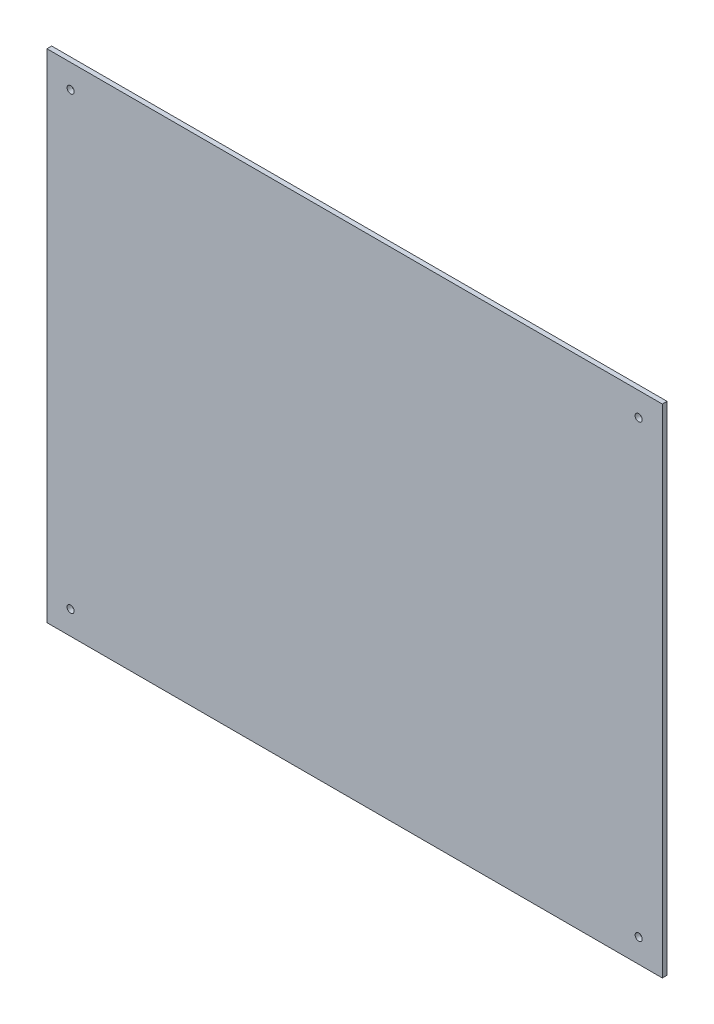
ISO-10303-21;
HEADER;
FILE_DESCRIPTION(('STEP AP214'),'2;1');
FILE_NAME('part.step','',(''),(''),'','','');
FILE_SCHEMA(('AUTOMOTIVE_DESIGN { 1 0 10303 214 1 1 1 1 }'));
ENDSEC;
DATA;
#1=APPLICATION_CONTEXT('core data for automotive mechanical design processes');
#2=APPLICATION_PROTOCOL_DEFINITION('international standard','automotive_design',2000,#1);
#3=PRODUCT_CONTEXT('',#1,'mechanical');
#4=PRODUCT('Part','Part','',(#3));
#5=PRODUCT_RELATED_PRODUCT_CATEGORY('part','',(#4));
#6=PRODUCT_DEFINITION_FORMATION('','',#4);
#7=PRODUCT_DEFINITION_CONTEXT('part definition',#1,'design');
#8=PRODUCT_DEFINITION('design','',#6,#7);
#9=PRODUCT_DEFINITION_SHAPE('','',#8);
#10=(LENGTH_UNIT() NAMED_UNIT(*) SI_UNIT(.MILLI.,.METRE.));
#11=(NAMED_UNIT(*) PLANE_ANGLE_UNIT() SI_UNIT($,.RADIAN.));
#12=(NAMED_UNIT(*) SI_UNIT($,.STERADIAN.) SOLID_ANGLE_UNIT());
#13=UNCERTAINTY_MEASURE_WITH_UNIT(LENGTH_MEASURE(1.E-05),#10,'distance_accuracy_value','');
#14=(GEOMETRIC_REPRESENTATION_CONTEXT(3) GLOBAL_UNCERTAINTY_ASSIGNED_CONTEXT((#13)) GLOBAL_UNIT_ASSIGNED_CONTEXT((#10,
#11,#12)) REPRESENTATION_CONTEXT('',''));
#15=CARTESIAN_POINT('',(0.,0.,0.));
#16=DIRECTION('',(0.,0.,1.));
#17=DIRECTION('',(1.,0.,0.));
#18=AXIS2_PLACEMENT_3D('',#15,#16,#17);
#19=CARTESIAN_POINT('',(0.,210.,2.));
#20=DIRECTION('',(1.,0.,0.));
#21=DIRECTION('',(0.,1.,0.));
#22=AXIS2_PLACEMENT_3D('',#19,#20,#21);
#23=PLANE('',#22);
#24=DIRECTION('',(0.,-1.,0.));
#25=VECTOR('',#24,1.);
#26=CARTESIAN_POINT('',(0.,210.,0.));
#27=LINE('',#26,#25);
#28=CARTESIAN_POINT('',(0.,210.,0.));
#29=VERTEX_POINT('',#28);
#30=CARTESIAN_POINT('',(0.,0.,0.));
#31=VERTEX_POINT('',#30);
#32=EDGE_CURVE('E98',#29,#31,#27,.T.);
#33=ORIENTED_EDGE('',*,*,#32,.T.);
#34=DIRECTION('',(0.,0.,-1.));
#35=VECTOR('',#34,1.);
#36=CARTESIAN_POINT('',(0.,0.,2.));
#37=LINE('',#36,#35);
#38=CARTESIAN_POINT('',(0.,0.,2.));
#39=VERTEX_POINT('',#38);
#40=EDGE_CURVE('E11',#39,#31,#37,.T.);
#41=ORIENTED_EDGE('',*,*,#40,.F.);
#42=DIRECTION('',(0.,-1.,0.));
#43=VECTOR('',#42,1.);
#44=CARTESIAN_POINT('',(0.,210.,2.));
#45=LINE('',#44,#43);
#46=CARTESIAN_POINT('',(0.,210.,2.));
#47=VERTEX_POINT('',#46);
#48=EDGE_CURVE('E86',#47,#39,#45,.T.);
#49=ORIENTED_EDGE('',*,*,#48,.F.);
#50=DIRECTION('',(0.,0.,-1.));
#51=VECTOR('',#50,1.);
#52=CARTESIAN_POINT('',(0.,210.,2.));
#53=LINE('',#52,#51);
#54=EDGE_CURVE('E94',#47,#29,#53,.T.);
#55=ORIENTED_EDGE('',*,*,#54,.T.);
#56=EDGE_LOOP('',(#33,#41,#49,#55));
#57=FACE_BOUND('',#56,.T.);
#58=ADVANCED_FACE('F35',(#57),#23,.F.);
#59=CARTESIAN_POINT('',(0.,0.,2.));
#60=DIRECTION('',(0.,1.,0.));
#61=DIRECTION('',(0.,0.,1.));
#62=AXIS2_PLACEMENT_3D('',#59,#60,#61);
#63=PLANE('',#62);
#64=DIRECTION('',(1.,0.,0.));
#65=VECTOR('',#64,1.);
#66=CARTESIAN_POINT('',(0.,0.,0.));
#67=LINE('',#66,#65);
#68=CARTESIAN_POINT('',(260.,0.,0.));
#69=VERTEX_POINT('',#68);
#70=EDGE_CURVE('E90',#31,#69,#67,.T.);
#71=ORIENTED_EDGE('',*,*,#70,.T.);
#72=DIRECTION('',(0.,0.,-1.));
#73=VECTOR('',#72,1.);
#74=CARTESIAN_POINT('',(260.,0.,2.));
#75=LINE('',#74,#73);
#76=CARTESIAN_POINT('',(260.,0.,2.));
#77=VERTEX_POINT('',#76);
#78=EDGE_CURVE('E43',#77,#69,#75,.T.);
#79=ORIENTED_EDGE('',*,*,#78,.F.);
#80=DIRECTION('',(1.,0.,0.));
#81=VECTOR('',#80,1.);
#82=CARTESIAN_POINT('',(0.,0.,2.));
#83=LINE('',#82,#81);
#84=EDGE_CURVE('E81',#39,#77,#83,.T.);
#85=ORIENTED_EDGE('',*,*,#84,.F.);
#86=ORIENTED_EDGE('',*,*,#40,.T.);
#87=EDGE_LOOP('',(#71,#79,#85,#86));
#88=FACE_BOUND('',#87,.T.);
#89=ADVANCED_FACE('F89',(#88),#63,.F.);
#90=CARTESIAN_POINT('',(260.,0.,2.));
#91=DIRECTION('',(-1.,0.,0.));
#92=DIRECTION('',(0.,0.,1.));
#93=AXIS2_PLACEMENT_3D('',#90,#91,#92);
#94=PLANE('',#93);
#95=DIRECTION('',(0.,1.,0.));
#96=VECTOR('',#95,1.);
#97=CARTESIAN_POINT('',(260.,0.,0.));
#98=LINE('',#97,#96);
#99=CARTESIAN_POINT('',(260.,210.,0.));
#100=VERTEX_POINT('',#99);
#101=EDGE_CURVE('E68',#69,#100,#98,.T.);
#102=ORIENTED_EDGE('',*,*,#101,.T.);
#103=DIRECTION('',(0.,0.,-1.));
#104=VECTOR('',#103,1.);
#105=CARTESIAN_POINT('',(260.,210.,2.));
#106=LINE('',#105,#104);
#107=CARTESIAN_POINT('',(260.,210.,2.));
#108=VERTEX_POINT('',#107);
#109=EDGE_CURVE('E91',#108,#100,#106,.T.);
#110=ORIENTED_EDGE('',*,*,#109,.F.);
#111=DIRECTION('',(0.,1.,0.));
#112=VECTOR('',#111,1.);
#113=CARTESIAN_POINT('',(260.,0.,2.));
#114=LINE('',#113,#112);
#115=EDGE_CURVE('E84',#77,#108,#114,.T.);
#116=ORIENTED_EDGE('',*,*,#115,.F.);
#117=ORIENTED_EDGE('',*,*,#78,.T.);
#118=EDGE_LOOP('',(#102,#110,#116,#117));
#119=FACE_BOUND('',#118,.T.);
#120=ADVANCED_FACE('F92',(#119),#94,.F.);
#121=CARTESIAN_POINT('',(260.,210.,2.));
#122=DIRECTION('',(0.,-1.,0.));
#123=DIRECTION('',(1.,0.,0.));
#124=AXIS2_PLACEMENT_3D('',#121,#122,#123);
#125=PLANE('',#124);
#126=DIRECTION('',(-1.,0.,0.));
#127=VECTOR('',#126,1.);
#128=CARTESIAN_POINT('',(260.,210.,0.));
#129=LINE('',#128,#127);
#130=EDGE_CURVE('E74',#100,#29,#129,.T.);
#131=ORIENTED_EDGE('',*,*,#130,.T.);
#132=ORIENTED_EDGE('',*,*,#54,.F.);
#133=DIRECTION('',(-1.,0.,0.));
#134=VECTOR('',#133,1.);
#135=CARTESIAN_POINT('',(260.,210.,2.));
#136=LINE('',#135,#134);
#137=EDGE_CURVE('E51',#108,#47,#136,.T.);
#138=ORIENTED_EDGE('',*,*,#137,.F.);
#139=ORIENTED_EDGE('',*,*,#109,.T.);
#140=EDGE_LOOP('',(#131,#132,#138,#139));
#141=FACE_BOUND('',#140,.T.);
#142=ADVANCED_FACE('F106',(#141),#125,.F.);
#143=CARTESIAN_POINT('',(0.,0.,2.));
#144=DIRECTION('',(0.,0.,1.));
#145=DIRECTION('',(1.,0.,0.));
#146=AXIS2_PLACEMENT_3D('',#143,#144,#145);
#147=PLANE('',#146);
#148=CARTESIAN_POINT('',(10.,10.,2.));
#149=DIRECTION('',(0.,0.,1.));
#150=DIRECTION('',(1.,0.,0.));
#151=AXIS2_PLACEMENT_3D('',#148,#149,#150);
#152=CIRCLE('',#151,1.5);
#153=CARTESIAN_POINT('',(11.5,10.,2.));
#154=VERTEX_POINT('',#153);
#155=EDGE_CURVE('E130',#154,#154,#152,.T.);
#156=ORIENTED_EDGE('',*,*,#155,.F.);
#157=EDGE_LOOP('',(#156));
#158=FACE_BOUND('',#157,.T.);
#159=CARTESIAN_POINT('',(250.,10.,2.));
#160=DIRECTION('',(0.,0.,1.));
#161=DIRECTION('',(1.,0.,0.));
#162=AXIS2_PLACEMENT_3D('',#159,#160,#161);
#163=CIRCLE('',#162,1.50000000000002);
#164=CARTESIAN_POINT('',(251.5,10.,2.));
#165=VERTEX_POINT('',#164);
#166=EDGE_CURVE('E124',#165,#165,#163,.T.);
#167=ORIENTED_EDGE('',*,*,#166,.F.);
#168=EDGE_LOOP('',(#167));
#169=FACE_BOUND('',#168,.T.);
#170=CARTESIAN_POINT('',(250.,200.,2.));
#171=DIRECTION('',(0.,0.,1.));
#172=DIRECTION('',(1.,0.,0.));
#173=AXIS2_PLACEMENT_3D('',#170,#171,#172);
#174=CIRCLE('',#173,1.50000000000002);
#175=CARTESIAN_POINT('',(251.5,200.,2.));
#176=VERTEX_POINT('',#175);
#177=EDGE_CURVE('E118',#176,#176,#174,.T.);
#178=ORIENTED_EDGE('',*,*,#177,.F.);
#179=EDGE_LOOP('',(#178));
#180=FACE_BOUND('',#179,.T.);
#181=CARTESIAN_POINT('',(10.,200.,2.));
#182=DIRECTION('',(0.,0.,1.));
#183=DIRECTION('',(1.,0.,0.));
#184=AXIS2_PLACEMENT_3D('',#181,#182,#183);
#185=CIRCLE('',#184,1.5);
#186=CARTESIAN_POINT('',(11.5,200.,2.));
#187=VERTEX_POINT('',#186);
#188=EDGE_CURVE('E112',#187,#187,#185,.T.);
#189=ORIENTED_EDGE('',*,*,#188,.F.);
#190=EDGE_LOOP('',(#189));
#191=FACE_BOUND('',#190,.T.);
#192=ORIENTED_EDGE('',*,*,#48,.T.);
#193=ORIENTED_EDGE('',*,*,#84,.T.);
#194=ORIENTED_EDGE('',*,*,#115,.T.);
#195=ORIENTED_EDGE('',*,*,#137,.T.);
#196=EDGE_LOOP('',(#192,#193,#194,#195));
#197=FACE_BOUND('',#196,.T.);
#198=ADVANCED_FACE('F82',(#158,#169,#180,#191,#197),#147,.T.);
#199=CARTESIAN_POINT('',(0.,0.,0.));
#200=DIRECTION('',(0.,0.,1.));
#201=DIRECTION('',(1.,0.,0.));
#202=AXIS2_PLACEMENT_3D('',#199,#200,#201);
#203=PLANE('',#202);
#204=CARTESIAN_POINT('',(10.,10.,0.));
#205=DIRECTION('',(0.,0.,1.));
#206=DIRECTION('',(1.,0.,0.));
#207=AXIS2_PLACEMENT_3D('',#204,#205,#206);
#208=CIRCLE('',#207,1.5);
#209=CARTESIAN_POINT('',(11.5,10.,0.));
#210=VERTEX_POINT('',#209);
#211=EDGE_CURVE('E127',#210,#210,#208,.T.);
#212=ORIENTED_EDGE('',*,*,#211,.T.);
#213=EDGE_LOOP('',(#212));
#214=FACE_BOUND('',#213,.T.);
#215=CARTESIAN_POINT('',(250.,10.,0.));
#216=DIRECTION('',(0.,0.,1.));
#217=DIRECTION('',(1.,0.,0.));
#218=AXIS2_PLACEMENT_3D('',#215,#216,#217);
#219=CIRCLE('',#218,1.50000000000002);
#220=CARTESIAN_POINT('',(251.5,10.,0.));
#221=VERTEX_POINT('',#220);
#222=EDGE_CURVE('E121',#221,#221,#219,.T.);
#223=ORIENTED_EDGE('',*,*,#222,.T.);
#224=EDGE_LOOP('',(#223));
#225=FACE_BOUND('',#224,.T.);
#226=CARTESIAN_POINT('',(250.,200.,0.));
#227=DIRECTION('',(0.,0.,1.));
#228=DIRECTION('',(1.,0.,0.));
#229=AXIS2_PLACEMENT_3D('',#226,#227,#228);
#230=CIRCLE('',#229,1.50000000000002);
#231=CARTESIAN_POINT('',(251.5,200.,0.));
#232=VERTEX_POINT('',#231);
#233=EDGE_CURVE('E115',#232,#232,#230,.T.);
#234=ORIENTED_EDGE('',*,*,#233,.T.);
#235=EDGE_LOOP('',(#234));
#236=FACE_BOUND('',#235,.T.);
#237=CARTESIAN_POINT('',(10.,200.,0.));
#238=DIRECTION('',(0.,0.,1.));
#239=DIRECTION('',(1.,0.,0.));
#240=AXIS2_PLACEMENT_3D('',#237,#238,#239);
#241=CIRCLE('',#240,1.5);
#242=CARTESIAN_POINT('',(11.5,200.,0.));
#243=VERTEX_POINT('',#242);
#244=EDGE_CURVE('E101',#243,#243,#241,.T.);
#245=ORIENTED_EDGE('',*,*,#244,.T.);
#246=EDGE_LOOP('',(#245));
#247=FACE_BOUND('',#246,.T.);
#248=ORIENTED_EDGE('',*,*,#32,.F.);
#249=ORIENTED_EDGE('',*,*,#130,.F.);
#250=ORIENTED_EDGE('',*,*,#101,.F.);
#251=ORIENTED_EDGE('',*,*,#70,.F.);
#252=EDGE_LOOP('',(#248,#249,#250,#251));
#253=FACE_BOUND('',#252,.T.);
#254=ADVANCED_FACE('F109',(#214,#225,#236,#247,#253),#203,.F.);
#255=CARTESIAN_POINT('',(10.,200.,0.));
#256=DIRECTION('',(0.,0.,1.));
#257=DIRECTION('',(1.,0.,0.));
#258=AXIS2_PLACEMENT_3D('',#255,#256,#257);
#259=CYLINDRICAL_SURFACE('',#258,1.5);
#260=ORIENTED_EDGE('',*,*,#244,.F.);
#261=EDGE_LOOP('',(#260));
#262=FACE_BOUND('',#261,.T.);
#263=ORIENTED_EDGE('',*,*,#188,.T.);
#264=EDGE_LOOP('',(#263));
#265=FACE_BOUND('',#264,.T.);
#266=ADVANCED_FACE('F154',(#262,#265),#259,.F.);
#267=CARTESIAN_POINT('',(250.,200.,0.));
#268=DIRECTION('',(0.,0.,1.));
#269=DIRECTION('',(1.,0.,0.));
#270=AXIS2_PLACEMENT_3D('',#267,#268,#269);
#271=CYLINDRICAL_SURFACE('',#270,1.50000000000002);
#272=ORIENTED_EDGE('',*,*,#233,.F.);
#273=EDGE_LOOP('',(#272));
#274=FACE_BOUND('',#273,.T.);
#275=ORIENTED_EDGE('',*,*,#177,.T.);
#276=EDGE_LOOP('',(#275));
#277=FACE_BOUND('',#276,.T.);
#278=ADVANCED_FACE('F156',(#274,#277),#271,.F.);
#279=CARTESIAN_POINT('',(250.,10.,0.));
#280=DIRECTION('',(0.,0.,1.));
#281=DIRECTION('',(1.,0.,0.));
#282=AXIS2_PLACEMENT_3D('',#279,#280,#281);
#283=CYLINDRICAL_SURFACE('',#282,1.50000000000002);
#284=ORIENTED_EDGE('',*,*,#222,.F.);
#285=EDGE_LOOP('',(#284));
#286=FACE_BOUND('',#285,.T.);
#287=ORIENTED_EDGE('',*,*,#166,.T.);
#288=EDGE_LOOP('',(#287));
#289=FACE_BOUND('',#288,.T.);
#290=ADVANCED_FACE('F141',(#286,#289),#283,.F.);
#291=CARTESIAN_POINT('',(10.,10.,0.));
#292=DIRECTION('',(0.,0.,1.));
#293=DIRECTION('',(1.,0.,0.));
#294=AXIS2_PLACEMENT_3D('',#291,#292,#293);
#295=CYLINDRICAL_SURFACE('',#294,1.5);
#296=ORIENTED_EDGE('',*,*,#211,.F.);
#297=EDGE_LOOP('',(#296));
#298=FACE_BOUND('',#297,.T.);
#299=ORIENTED_EDGE('',*,*,#155,.T.);
#300=EDGE_LOOP('',(#299));
#301=FACE_BOUND('',#300,.T.);
#302=ADVANCED_FACE('F138',(#298,#301),#295,.F.);
#303=CLOSED_SHELL('',(#58,#89,#120,#142,#198,#254,#266,#278,#290,#302));
#304=MANIFOLD_SOLID_BREP('B2',#303);
#305=ADVANCED_BREP_SHAPE_REPRESENTATION('',(#18,#304),#14);
#306=SHAPE_DEFINITION_REPRESENTATION(#9,#305);
ENDSEC;
END-ISO-10303-21;
